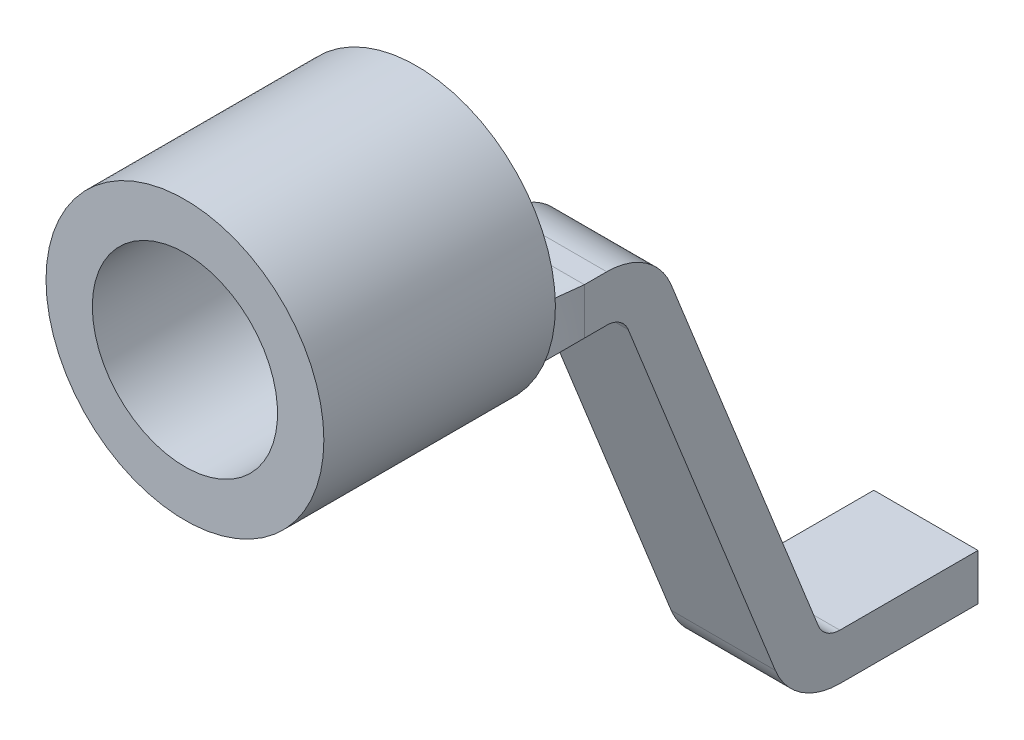
ISO-10303-21;
HEADER;
FILE_DESCRIPTION(('STEP AP214'),'2;1');
FILE_NAME('part.step','',(''),(''),'','','');
FILE_SCHEMA(('AUTOMOTIVE_DESIGN { 1 0 10303 214 1 1 1 1 }'));
ENDSEC;
DATA;
#1=APPLICATION_CONTEXT('core data for automotive mechanical design processes');
#2=APPLICATION_PROTOCOL_DEFINITION('international standard','automotive_design',2000,#1);
#3=PRODUCT_CONTEXT('',#1,'mechanical');
#4=PRODUCT('Part','Part','',(#3));
#5=PRODUCT_RELATED_PRODUCT_CATEGORY('part','',(#4));
#6=PRODUCT_DEFINITION_FORMATION('','',#4);
#7=PRODUCT_DEFINITION_CONTEXT('part definition',#1,'design');
#8=PRODUCT_DEFINITION('design','',#6,#7);
#9=PRODUCT_DEFINITION_SHAPE('','',#8);
#10=(LENGTH_UNIT() NAMED_UNIT(*) SI_UNIT(.MILLI.,.METRE.));
#11=(NAMED_UNIT(*) PLANE_ANGLE_UNIT() SI_UNIT($,.RADIAN.));
#12=(NAMED_UNIT(*) SI_UNIT($,.STERADIAN.) SOLID_ANGLE_UNIT());
#13=UNCERTAINTY_MEASURE_WITH_UNIT(LENGTH_MEASURE(1.E-05),#10,'distance_accuracy_value','');
#14=(GEOMETRIC_REPRESENTATION_CONTEXT(3) GLOBAL_UNCERTAINTY_ASSIGNED_CONTEXT((#13)) GLOBAL_UNIT_ASSIGNED_CONTEXT((#10,
#11,#12)) REPRESENTATION_CONTEXT('',''));
#15=CARTESIAN_POINT('',(0.,0.,0.));
#16=DIRECTION('',(0.,0.,1.));
#17=DIRECTION('',(1.,0.,0.));
#18=AXIS2_PLACEMENT_3D('',#15,#16,#17);
#19=CARTESIAN_POINT('',(0.225,-0.656214886532175,-8.79668819152799));
#20=DIRECTION('',(-1.,0.,0.));
#21=DIRECTION('',(0.,0.,1.));
#22=AXIS2_PLACEMENT_3D('',#19,#20,#21);
#23=PLANE('',#22);
#24=CARTESIAN_POINT('',(0.225,-0.656214886532175,-8.79668819152799));
#25=DIRECTION('',(1.,0.,0.));
#26=DIRECTION('',(0.,0.,-1.));
#27=AXIS2_PLACEMENT_3D('',#24,#25,#26);
#28=CIRCLE('',#27,0.0999999999999994);
#29=CARTESIAN_POINT('',(0.225,-0.619161509804707,-8.88957009112685));
#30=VERTEX_POINT('',#29);
#31=CARTESIAN_POINT('',(0.225,-0.556214886532175,-8.79668819152799));
#32=VERTEX_POINT('',#31);
#33=EDGE_CURVE('E120',#30,#32,#28,.T.);
#34=ORIENTED_EDGE('',*,*,#33,.F.);
#35=DIRECTION('',(0.,0.928818995988579,0.370533767274682));
#36=VECTOR('',#35,1.);
#37=CARTESIAN_POINT('',(0.225,-2.2111601301824,-9.52466610967544));
#38=LINE('',#37,#36);
#39=CARTESIAN_POINT('',(0.225,-2.2111601301824,-9.52466610967544));
#40=VERTEX_POINT('',#39);
#41=EDGE_CURVE('E123',#30,#40,#38,.F.);
#42=ORIENTED_EDGE('',*,*,#41,.T.);
#43=CARTESIAN_POINT('',(0.225,-2.1,-9.80331180847201));
#44=DIRECTION('',(1.,0.,0.));
#45=DIRECTION('',(0.,0.,-1.));
#46=AXIS2_PLACEMENT_3D('',#43,#44,#45);
#47=CIRCLE('',#46,0.3);
#48=CARTESIAN_POINT('',(0.225,-2.4,-9.80331180847201));
#49=VERTEX_POINT('',#48);
#50=EDGE_CURVE('E139',#49,#40,#47,.F.);
#51=ORIENTED_EDGE('',*,*,#50,.F.);
#52=DIRECTION('',(0.,0.,1.));
#53=VECTOR('',#52,1.);
#54=CARTESIAN_POINT('',(0.225,-2.4,-10.4));
#55=LINE('',#54,#53);
#56=CARTESIAN_POINT('',(0.225,-2.4,-10.4));
#57=VERTEX_POINT('',#56);
#58=EDGE_CURVE('E159',#49,#57,#55,.F.);
#59=ORIENTED_EDGE('',*,*,#58,.T.);
#60=DIRECTION('',(0.,1.,0.));
#61=VECTOR('',#60,1.);
#62=CARTESIAN_POINT('',(0.225,-2.2,-10.4));
#63=LINE('',#62,#61);
#64=CARTESIAN_POINT('',(0.225,-2.2,-10.4));
#65=VERTEX_POINT('',#64);
#66=EDGE_CURVE('E171',#57,#65,#63,.T.);
#67=ORIENTED_EDGE('',*,*,#66,.T.);
#68=DIRECTION('',(0.,0.,-1.));
#69=VECTOR('',#68,1.);
#70=CARTESIAN_POINT('',(0.225,-2.2,-9.80331180847201));
#71=LINE('',#70,#69);
#72=CARTESIAN_POINT('',(0.225,-2.2,-9.80331180847201));
#73=VERTEX_POINT('',#72);
#74=EDGE_CURVE('E176',#65,#73,#71,.F.);
#75=ORIENTED_EDGE('',*,*,#74,.T.);
#76=CARTESIAN_POINT('',(0.225,-2.1,-9.80331180847201));
#77=DIRECTION('',(1.,0.,0.));
#78=DIRECTION('',(0.,0.,-1.));
#79=AXIS2_PLACEMENT_3D('',#76,#77,#78);
#80=CIRCLE('',#79,0.0999999999999994);
#81=CARTESIAN_POINT('',(0.225,-2.13705337672747,-9.71042990887315));
#82=VERTEX_POINT('',#81);
#83=EDGE_CURVE('E179',#73,#82,#80,.F.);
#84=ORIENTED_EDGE('',*,*,#83,.T.);
#85=DIRECTION('',(0.,-0.928818995988579,-0.370533767274682));
#86=VECTOR('',#85,1.);
#87=CARTESIAN_POINT('',(0.225,-0.545054756349771,-9.07533389032456));
#88=LINE('',#87,#86);
#89=CARTESIAN_POINT('',(0.225,-0.545054756349771,-9.07533389032456));
#90=VERTEX_POINT('',#89);
#91=EDGE_CURVE('E182',#82,#90,#88,.F.);
#92=ORIENTED_EDGE('',*,*,#91,.T.);
#93=CARTESIAN_POINT('',(0.225,-0.656214886532175,-8.79668819152799));
#94=DIRECTION('',(1.,0.,0.));
#95=DIRECTION('',(0.,0.,-1.));
#96=AXIS2_PLACEMENT_3D('',#93,#94,#95);
#97=CIRCLE('',#96,0.3);
#98=CARTESIAN_POINT('',(0.225,-0.356214886532175,-8.79668819152799));
#99=VERTEX_POINT('',#98);
#100=EDGE_CURVE('E187',#99,#90,#97,.F.);
#101=ORIENTED_EDGE('',*,*,#100,.F.);
#102=DIRECTION('',(0.,0.,1.));
#103=VECTOR('',#102,1.);
#104=CARTESIAN_POINT('',(0.225,-0.356214886532175,-8.79668819152799));
#105=LINE('',#104,#103);
#106=CARTESIAN_POINT('',(0.224999983599127,-0.356214889723793,-8.69999989066085));
#107=VERTEX_POINT('',#106);
#108=EDGE_CURVE('E130',#107,#99,#105,.F.);
#109=ORIENTED_EDGE('',*,*,#108,.F.);
#110=DIRECTION('',(0.,1.,0.));
#111=VECTOR('',#110,1.);
#112=CARTESIAN_POINT('',(0.225,-0.656214886532175,-8.7));
#113=LINE('',#112,#111);
#114=CARTESIAN_POINT('',(0.225,-0.556214886532175,-8.7));
#115=VERTEX_POINT('',#114);
#116=EDGE_CURVE('E189',#115,#107,#113,.T.);
#117=ORIENTED_EDGE('',*,*,#116,.F.);
#118=DIRECTION('',(0.,0.,1.));
#119=VECTOR('',#118,1.);
#120=CARTESIAN_POINT('',(0.225,-0.556214886532174,-8.79668819152799));
#121=LINE('',#120,#119);
#122=EDGE_CURVE('E126',#32,#115,#121,.T.);
#123=ORIENTED_EDGE('',*,*,#122,.F.);
#124=EDGE_LOOP('',(#34,#42,#51,#59,#67,#75,#84,#92,#101,#109,#117,#123));
#125=FACE_BOUND('',#124,.T.);
#126=ADVANCED_FACE('F18',(#125),#23,.F.);
#127=CARTESIAN_POINT('',(0.225,-0.656214886532175,-8.79668819152799));
#128=DIRECTION('',(1.,0.,0.));
#129=DIRECTION('',(0.,0.,-1.));
#130=AXIS2_PLACEMENT_3D('',#127,#128,#129);
#131=CYLINDRICAL_SURFACE('',#130,0.3);
#132=DIRECTION('',(1.,0.,0.));
#133=VECTOR('',#132,1.);
#134=CARTESIAN_POINT('',(0.225,-0.356214886532175,-8.79668819152799));
#135=LINE('',#134,#133);
#136=CARTESIAN_POINT('',(-0.225,-0.356214886532175,-8.79668819152799));
#137=VERTEX_POINT('',#136);
#138=EDGE_CURVE('E147',#137,#99,#135,.T.);
#139=ORIENTED_EDGE('',*,*,#138,.T.);
#140=ORIENTED_EDGE('',*,*,#100,.T.);
#141=DIRECTION('',(1.,0.,0.));
#142=VECTOR('',#141,1.);
#143=CARTESIAN_POINT('',(0.225,-0.545054756349771,-9.07533389032456));
#144=LINE('',#143,#142);
#145=CARTESIAN_POINT('',(-0.225,-0.545054756349771,-9.07533389032456));
#146=VERTEX_POINT('',#145);
#147=EDGE_CURVE('E180',#90,#146,#144,.F.);
#148=ORIENTED_EDGE('',*,*,#147,.T.);
#149=CARTESIAN_POINT('',(-0.225,-0.656214886532175,-8.79668819152799));
#150=DIRECTION('',(1.,0.,0.));
#151=DIRECTION('',(0.,0.,-1.));
#152=AXIS2_PLACEMENT_3D('',#149,#150,#151);
#153=CIRCLE('',#152,0.3);
#154=EDGE_CURVE('E309',#137,#146,#153,.F.);
#155=ORIENTED_EDGE('',*,*,#154,.F.);
#156=EDGE_LOOP('',(#139,#140,#148,#155));
#157=FACE_BOUND('',#156,.T.);
#158=ADVANCED_FACE('F389',(#157),#131,.T.);
#159=CARTESIAN_POINT('',(0.225,-0.545054756349771,-9.07533389032456));
#160=DIRECTION('',(0.,-0.370533767274682,0.928818995988579));
#161=DIRECTION('',(0.,-0.928818995988579,-0.370533767274682));
#162=AXIS2_PLACEMENT_3D('',#159,#160,#161);
#163=PLANE('',#162);
#164=DIRECTION('',(0.,-0.928818995988578,-0.370533767274683));
#165=VECTOR('',#164,1.);
#166=CARTESIAN_POINT('',(-0.225,-0.545054756349771,-9.07533389032456));
#167=LINE('',#166,#165);
#168=CARTESIAN_POINT('',(-0.225,-2.13705337672747,-9.71042990887315));
#169=VERTEX_POINT('',#168);
#170=EDGE_CURVE('E306',#146,#169,#167,.T.);
#171=ORIENTED_EDGE('',*,*,#170,.F.);
#172=ORIENTED_EDGE('',*,*,#147,.F.);
#173=ORIENTED_EDGE('',*,*,#91,.F.);
#174=DIRECTION('',(1.,0.,0.));
#175=VECTOR('',#174,1.);
#176=CARTESIAN_POINT('',(0.225,-2.13705337672747,-9.71042990887315));
#177=LINE('',#176,#175);
#178=EDGE_CURVE('E177',#82,#169,#177,.F.);
#179=ORIENTED_EDGE('',*,*,#178,.T.);
#180=EDGE_LOOP('',(#171,#172,#173,#179));
#181=FACE_BOUND('',#180,.T.);
#182=ADVANCED_FACE('F386',(#181),#163,.F.);
#183=CARTESIAN_POINT('',(0.225,-2.1,-9.80331180847201));
#184=DIRECTION('',(1.,0.,0.));
#185=DIRECTION('',(0.,0.,-1.));
#186=AXIS2_PLACEMENT_3D('',#183,#184,#185);
#187=CYLINDRICAL_SURFACE('',#186,0.0999999999999994);
#188=CARTESIAN_POINT('',(-0.225,-2.1,-9.80331180847201));
#189=DIRECTION('',(1.,0.,0.));
#190=DIRECTION('',(0.,0.,-1.));
#191=AXIS2_PLACEMENT_3D('',#188,#189,#190);
#192=CIRCLE('',#191,0.0999999999999994);
#193=CARTESIAN_POINT('',(-0.225,-2.2,-9.80331180847201));
#194=VERTEX_POINT('',#193);
#195=EDGE_CURVE('E303',#169,#194,#192,.T.);
#196=ORIENTED_EDGE('',*,*,#195,.F.);
#197=ORIENTED_EDGE('',*,*,#178,.F.);
#198=ORIENTED_EDGE('',*,*,#83,.F.);
#199=DIRECTION('',(1.,0.,0.));
#200=VECTOR('',#199,1.);
#201=CARTESIAN_POINT('',(0.225,-2.2,-9.80331180847201));
#202=LINE('',#201,#200);
#203=EDGE_CURVE('E174',#73,#194,#202,.F.);
#204=ORIENTED_EDGE('',*,*,#203,.T.);
#205=EDGE_LOOP('',(#196,#197,#198,#204));
#206=FACE_BOUND('',#205,.T.);
#207=ADVANCED_FACE('F382',(#206),#187,.F.);
#208=CARTESIAN_POINT('',(0.225,-2.2,-9.80331180847201));
#209=DIRECTION('',(0.,-1.,0.));
#210=DIRECTION('',(0.,0.,-1.));
#211=AXIS2_PLACEMENT_3D('',#208,#209,#210);
#212=PLANE('',#211);
#213=DIRECTION('',(0.,0.,1.));
#214=VECTOR('',#213,1.);
#215=CARTESIAN_POINT('',(-0.225,-2.2,-8.79668819152799));
#216=LINE('',#215,#214);
#217=CARTESIAN_POINT('',(-0.225,-2.2,-10.4));
#218=VERTEX_POINT('',#217);
#219=EDGE_CURVE('E166',#194,#218,#216,.F.);
#220=ORIENTED_EDGE('',*,*,#219,.F.);
#221=ORIENTED_EDGE('',*,*,#203,.F.);
#222=ORIENTED_EDGE('',*,*,#74,.F.);
#223=DIRECTION('',(1.,0.,0.));
#224=VECTOR('',#223,1.);
#225=CARTESIAN_POINT('',(0.225,-2.2,-10.4));
#226=LINE('',#225,#224);
#227=EDGE_CURVE('E169',#65,#218,#226,.F.);
#228=ORIENTED_EDGE('',*,*,#227,.T.);
#229=EDGE_LOOP('',(#220,#221,#222,#228));
#230=FACE_BOUND('',#229,.T.);
#231=ADVANCED_FACE('F378',(#230),#212,.F.);
#232=CARTESIAN_POINT('',(0.225,-2.2,-10.4));
#233=DIRECTION('',(0.,0.,1.));
#234=DIRECTION('',(1.,0.,0.));
#235=AXIS2_PLACEMENT_3D('',#232,#233,#234);
#236=PLANE('',#235);
#237=DIRECTION('',(0.,1.,0.));
#238=VECTOR('',#237,1.);
#239=CARTESIAN_POINT('',(-0.225,-0.656214886532175,-10.4));
#240=LINE('',#239,#238);
#241=CARTESIAN_POINT('',(-0.225,-2.4,-10.4));
#242=VERTEX_POINT('',#241);
#243=EDGE_CURVE('E162',#218,#242,#240,.F.);
#244=ORIENTED_EDGE('',*,*,#243,.F.);
#245=ORIENTED_EDGE('',*,*,#227,.F.);
#246=ORIENTED_EDGE('',*,*,#66,.F.);
#247=DIRECTION('',(1.,0.,0.));
#248=VECTOR('',#247,1.);
#249=CARTESIAN_POINT('',(0.225,-2.4,-10.4));
#250=LINE('',#249,#248);
#251=EDGE_CURVE('E157',#57,#242,#250,.F.);
#252=ORIENTED_EDGE('',*,*,#251,.T.);
#253=EDGE_LOOP('',(#244,#245,#246,#252));
#254=FACE_BOUND('',#253,.T.);
#255=ADVANCED_FACE('F374',(#254),#236,.F.);
#256=CARTESIAN_POINT('',(0.225,-2.4,-10.4));
#257=DIRECTION('',(0.,1.,0.));
#258=DIRECTION('',(0.,0.,1.));
#259=AXIS2_PLACEMENT_3D('',#256,#257,#258);
#260=PLANE('',#259);
#261=DIRECTION('',(0.,0.,1.));
#262=VECTOR('',#261,1.);
#263=CARTESIAN_POINT('',(-0.225,-2.4,-8.79668819152799));
#264=LINE('',#263,#262);
#265=CARTESIAN_POINT('',(-0.225,-2.4,-9.80331180847201));
#266=VERTEX_POINT('',#265);
#267=EDGE_CURVE('E165',#242,#266,#264,.T.);
#268=ORIENTED_EDGE('',*,*,#267,.F.);
#269=ORIENTED_EDGE('',*,*,#251,.F.);
#270=ORIENTED_EDGE('',*,*,#58,.F.);
#271=DIRECTION('',(1.,0.,0.));
#272=VECTOR('',#271,1.);
#273=CARTESIAN_POINT('',(0.225,-2.4,-9.80331180847201));
#274=LINE('',#273,#272);
#275=EDGE_CURVE('E154',#266,#49,#274,.T.);
#276=ORIENTED_EDGE('',*,*,#275,.F.);
#277=EDGE_LOOP('',(#268,#269,#270,#276));
#278=FACE_BOUND('',#277,.T.);
#279=ADVANCED_FACE('F370',(#278),#260,.F.);
#280=CARTESIAN_POINT('',(0.225,-2.1,-9.80331180847201));
#281=DIRECTION('',(1.,0.,0.));
#282=DIRECTION('',(0.,0.,-1.));
#283=AXIS2_PLACEMENT_3D('',#280,#281,#282);
#284=CYLINDRICAL_SURFACE('',#283,0.3);
#285=ORIENTED_EDGE('',*,*,#275,.T.);
#286=ORIENTED_EDGE('',*,*,#50,.T.);
#287=DIRECTION('',(1.,0.,0.));
#288=VECTOR('',#287,1.);
#289=CARTESIAN_POINT('',(0.225,-2.2111601301824,-9.52466610967544));
#290=LINE('',#289,#288);
#291=CARTESIAN_POINT('',(-0.225,-2.2111601301824,-9.52466610967544));
#292=VERTEX_POINT('',#291);
#293=EDGE_CURVE('E138',#40,#292,#290,.F.);
#294=ORIENTED_EDGE('',*,*,#293,.T.);
#295=CARTESIAN_POINT('',(-0.225,-2.1,-9.80331180847201));
#296=DIRECTION('',(1.,0.,0.));
#297=DIRECTION('',(0.,0.,-1.));
#298=AXIS2_PLACEMENT_3D('',#295,#296,#297);
#299=CIRCLE('',#298,0.3);
#300=EDGE_CURVE('E296',#266,#292,#299,.F.);
#301=ORIENTED_EDGE('',*,*,#300,.F.);
#302=EDGE_LOOP('',(#285,#286,#294,#301));
#303=FACE_BOUND('',#302,.T.);
#304=ADVANCED_FACE('F367',(#303),#284,.T.);
#305=CARTESIAN_POINT('',(0.225,-2.2111601301824,-9.52466610967544));
#306=DIRECTION('',(0.,0.370533767274682,-0.928818995988579));
#307=DIRECTION('',(0.,0.928818995988579,0.370533767274682));
#308=AXIS2_PLACEMENT_3D('',#305,#306,#307);
#309=PLANE('',#308);
#310=DIRECTION('',(0.,0.928818995988578,0.370533767274683));
#311=VECTOR('',#310,1.);
#312=CARTESIAN_POINT('',(-0.225,-2.2111601301824,-9.52466610967544));
#313=LINE('',#312,#311);
#314=CARTESIAN_POINT('',(-0.225,-0.619161509804707,-8.88957009112685));
#315=VERTEX_POINT('',#314);
#316=EDGE_CURVE('E293',#292,#315,#313,.T.);
#317=ORIENTED_EDGE('',*,*,#316,.F.);
#318=ORIENTED_EDGE('',*,*,#293,.F.);
#319=ORIENTED_EDGE('',*,*,#41,.F.);
#320=DIRECTION('',(1.,0.,0.));
#321=VECTOR('',#320,1.);
#322=CARTESIAN_POINT('',(0.225,-0.619161509804706,-8.88957009112685));
#323=LINE('',#322,#321);
#324=EDGE_CURVE('E136',#30,#315,#323,.F.);
#325=ORIENTED_EDGE('',*,*,#324,.T.);
#326=EDGE_LOOP('',(#317,#318,#319,#325));
#327=FACE_BOUND('',#326,.T.);
#328=ADVANCED_FACE('F135',(#327),#309,.F.);
#329=CARTESIAN_POINT('',(0.225,-0.656214886532175,-8.79668819152799));
#330=DIRECTION('',(1.,0.,0.));
#331=DIRECTION('',(0.,0.,-1.));
#332=AXIS2_PLACEMENT_3D('',#329,#330,#331);
#333=CYLINDRICAL_SURFACE('',#332,0.0999999999999994);
#334=CARTESIAN_POINT('',(-0.225,-0.656214886532175,-8.79668819152799));
#335=DIRECTION('',(1.,0.,0.));
#336=DIRECTION('',(0.,0.,-1.));
#337=AXIS2_PLACEMENT_3D('',#334,#335,#336);
#338=CIRCLE('',#337,0.0999999999999994);
#339=CARTESIAN_POINT('',(-0.225,-0.556214886532175,-8.79668819152799));
#340=VERTEX_POINT('',#339);
#341=EDGE_CURVE('E143',#315,#340,#338,.T.);
#342=ORIENTED_EDGE('',*,*,#341,.F.);
#343=ORIENTED_EDGE('',*,*,#324,.F.);
#344=ORIENTED_EDGE('',*,*,#33,.T.);
#345=DIRECTION('',(1.,0.,0.));
#346=VECTOR('',#345,1.);
#347=CARTESIAN_POINT('',(0.225,-0.556214886532175,-8.79668819152799));
#348=LINE('',#347,#346);
#349=EDGE_CURVE('E145',#32,#340,#348,.F.);
#350=ORIENTED_EDGE('',*,*,#349,.T.);
#351=EDGE_LOOP('',(#342,#343,#344,#350));
#352=FACE_BOUND('',#351,.T.);
#353=ADVANCED_FACE('F141',(#352),#333,.F.);
#354=CARTESIAN_POINT('',(0.225,-0.556214886532175,-8.79668819152799));
#355=DIRECTION('',(0.,1.,0.));
#356=DIRECTION('',(0.,0.,1.));
#357=AXIS2_PLACEMENT_3D('',#354,#355,#356);
#358=PLANE('',#357);
#359=DIRECTION('',(0.,0.,1.));
#360=VECTOR('',#359,1.);
#361=CARTESIAN_POINT('',(-0.225,-0.556214886532174,-8.79668819152799));
#362=LINE('',#361,#360);
#363=CARTESIAN_POINT('',(-0.225,-0.556214886532175,-8.7));
#364=VERTEX_POINT('',#363);
#365=EDGE_CURVE('E184',#340,#364,#362,.T.);
#366=ORIENTED_EDGE('',*,*,#365,.F.);
#367=ORIENTED_EDGE('',*,*,#349,.F.);
#368=ORIENTED_EDGE('',*,*,#122,.T.);
#369=DIRECTION('',(1.,0.,0.));
#370=VECTOR('',#369,1.);
#371=CARTESIAN_POINT('',(0.,-0.556214886532175,-8.7));
#372=LINE('',#371,#370);
#373=EDGE_CURVE('E288',#364,#115,#372,.T.);
#374=ORIENTED_EDGE('',*,*,#373,.F.);
#375=EDGE_LOOP('',(#366,#367,#368,#374));
#376=FACE_BOUND('',#375,.T.);
#377=ADVANCED_FACE('F359',(#376),#358,.F.);
#378=CARTESIAN_POINT('',(0.225,-0.356214886532175,-8.7));
#379=DIRECTION('',(0.,-1.,0.));
#380=DIRECTION('',(0.,0.,-1.));
#381=AXIS2_PLACEMENT_3D('',#378,#379,#380);
#382=PLANE('',#381);
#383=DIRECTION('',(0.,0.,1.));
#384=VECTOR('',#383,1.);
#385=CARTESIAN_POINT('',(-0.225,-0.356214886532175,-8.79668819152799));
#386=LINE('',#385,#384);
#387=CARTESIAN_POINT('',(-0.225,-0.356214886532175,-8.7));
#388=VERTEX_POINT('',#387);
#389=EDGE_CURVE('E310',#388,#137,#386,.F.);
#390=ORIENTED_EDGE('',*,*,#389,.F.);
#391=DIRECTION('',(-1.,0.,0.));
#392=VECTOR('',#391,1.);
#393=CARTESIAN_POINT('',(0.,-0.356214886532175,-8.7));
#394=LINE('',#393,#392);
#395=EDGE_CURVE('E151',#107,#388,#394,.T.);
#396=ORIENTED_EDGE('',*,*,#395,.F.);
#397=ORIENTED_EDGE('',*,*,#108,.T.);
#398=ORIENTED_EDGE('',*,*,#138,.F.);
#399=EDGE_LOOP('',(#390,#396,#397,#398));
#400=FACE_BOUND('',#399,.T.);
#401=ADVANCED_FACE('F356',(#400),#382,.F.);
#402=CARTESIAN_POINT('',(-0.225,-0.656214886532175,-8.79668819152799));
#403=DIRECTION('',(-1.,0.,0.));
#404=DIRECTION('',(0.,0.,1.));
#405=AXIS2_PLACEMENT_3D('',#402,#403,#404);
#406=PLANE('',#405);
#407=ORIENTED_EDGE('',*,*,#316,.T.);
#408=ORIENTED_EDGE('',*,*,#341,.T.);
#409=ORIENTED_EDGE('',*,*,#365,.T.);
#410=DIRECTION('',(0.,-1.,0.));
#411=VECTOR('',#410,1.);
#412=CARTESIAN_POINT('',(-0.225,-0.457288396273213,-8.7));
#413=LINE('',#412,#411);
#414=EDGE_CURVE('E215',#388,#364,#413,.T.);
#415=ORIENTED_EDGE('',*,*,#414,.F.);
#416=ORIENTED_EDGE('',*,*,#389,.T.);
#417=ORIENTED_EDGE('',*,*,#154,.T.);
#418=ORIENTED_EDGE('',*,*,#170,.T.);
#419=ORIENTED_EDGE('',*,*,#195,.T.);
#420=ORIENTED_EDGE('',*,*,#219,.T.);
#421=ORIENTED_EDGE('',*,*,#243,.T.);
#422=ORIENTED_EDGE('',*,*,#267,.T.);
#423=ORIENTED_EDGE('',*,*,#300,.T.);
#424=EDGE_LOOP('',(#407,#408,#409,#415,#416,#417,#418,#419,#420,#421,#422,#423));
#425=FACE_BOUND('',#424,.T.);
#426=ADVANCED_FACE('F231',(#425),#406,.T.);
#427=CARTESIAN_POINT('',(0.225,-0.556214886532175,-8.2));
#428=CARTESIAN_POINT('',(0.225,-0.556214886532175,-8.7));
#429=CARTESIAN_POINT('',(0.155473139183478,-0.584339886532175,-8.2));
#430=CARTESIAN_POINT('',(0.15,-0.556214886532175,-8.7));
#431=CARTESIAN_POINT('',(0.0778402017205783,-0.6,-8.2));
#432=CARTESIAN_POINT('',(0.0749999999999999,-0.556214886532175,-8.7));
#433=CARTESIAN_POINT('',(-0.0778402017205781,-0.6,-8.2));
#434=CARTESIAN_POINT('',(-0.0750000000000001,-0.556214886532175,-8.7));
#435=CARTESIAN_POINT('',(-0.155473139183478,-0.584339886532175,-8.2));
#436=CARTESIAN_POINT('',(-0.15,-0.556214886532175,-8.7));
#437=CARTESIAN_POINT('',(-0.225,-0.556214886532175,-8.2));
#438=CARTESIAN_POINT('',(-0.225,-0.556214886532175,-8.7));
#439=B_SPLINE_SURFACE_WITH_KNOTS('',3,1,((#427,#428),(#429,#430),(#431,#432),(#433,#434),(#435,
#436),(#437,#438)),.UNSPECIFIED.,.F.,.F.,.F.,(4,2,4),(2,2),(0.,0.5,1.),(0.,1.),.UNSPECIFIED.);
#440=CARTESIAN_POINT('',(0.225,-0.556214886532175,-8.20000000015858));
#441=CARTESIAN_POINT('',(0.225,-0.556214886532175,-8.26738111335785));
#442=CARTESIAN_POINT('',(0.225,-0.556214886532175,-8.33476222655712));
#443=CARTESIAN_POINT('',(0.225,-0.556214886532175,-8.45178611646365));
#444=CARTESIAN_POINT('',(0.225,-0.556214886532175,-8.50142889317092));
#445=CARTESIAN_POINT('',(0.225,-0.556214886532175,-8.60071444658546));
#446=CARTESIAN_POINT('',(0.225,-0.556214886532175,-8.65035722329273));
#447=CARTESIAN_POINT('',(0.225,-0.556214886532175,-8.7));
#448=B_SPLINE_CURVE_WITH_KNOTS('',3,(#440,#441,#442,#443,#444,#445,#446,#447),.UNSPECIFIED.,.F.,
.F.,(4,2,2,4),(0.,0.202143339597805,0.351071669719606,0.499999999841416),.UNSPECIFIED.);
#449=CARTESIAN_POINT('',(0.225175090043262,-0.556649823895789,-8.20000000015858));
#450=VERTEX_POINT('',#449);
#451=EDGE_CURVE('E256',#450,#115,#448,.T.);
#452=CARTESIAN_POINT('',(0.225,-0.556214886532175,-8.2));
#453=CARTESIAN_POINT('',(0.216269338703329,-0.559746102363361,-8.2));
#454=CARTESIAN_POINT('',(0.207453176337116,-0.563064677519512,-8.2));
#455=CARTESIAN_POINT('',(0.189599520785112,-0.569303313123354,-8.2));
#456=CARTESIAN_POINT('',(0.180560804047663,-0.572219874104915,-8.2));
#457=CARTESIAN_POINT('',(0.162292924092735,-0.577641926376812,-8.2));
#458=CARTESIAN_POINT('',(0.153062875451116,-0.580144430870225,-8.2));
#459=CARTESIAN_POINT('',(0.134442706723738,-0.584725277340994,-8.2));
#460=CARTESIAN_POINT('',(0.125051976261823,-0.586801137885077,-8.2));
#461=CARTESIAN_POINT('',(0.106141031713695,-0.590515748107865,-8.2));
#462=CARTESIAN_POINT('',(0.0966204273157555,-0.592152510845649,-8.2));
#463=CARTESIAN_POINT('',(0.0774803288012702,-0.594975947206018,-8.2));
#464=CARTESIAN_POINT('',(0.0678606112331755,-0.596161107488451,-8.2));
#465=CARTESIAN_POINT('',(0.0485529643319555,-0.598068390349088,-8.2));
#466=CARTESIAN_POINT('',(0.0388649290330745,-0.598789442315896,-8.2));
#467=CARTESIAN_POINT('',(0.0194512849500396,-0.599755582785358,-8.2));
#468=CARTESIAN_POINT('',(0.00972564247501984,-0.6,-8.2));
#469=CARTESIAN_POINT('',(-0.00972564247501962,-0.6,-8.2));
#470=CARTESIAN_POINT('',(-0.0194512849500394,-0.599755582785358,-8.2));
#471=CARTESIAN_POINT('',(-0.0388649290330743,-0.598789442315896,-8.2));
#472=CARTESIAN_POINT('',(-0.0485529643319553,-0.598068390349088,-8.2));
#473=CARTESIAN_POINT('',(-0.0678606112331753,-0.596161107488451,-8.2));
#474=CARTESIAN_POINT('',(-0.07748032880127,-0.594975947206018,-8.2));
#475=CARTESIAN_POINT('',(-0.0966204273157552,-0.592152510845649,-8.2));
#476=CARTESIAN_POINT('',(-0.106141031713695,-0.590515748107865,-8.2));
#477=CARTESIAN_POINT('',(-0.125051976261823,-0.586801137885077,-8.2));
#478=CARTESIAN_POINT('',(-0.134442706723738,-0.584725277340994,-8.2));
#479=CARTESIAN_POINT('',(-0.153062875451116,-0.580144430870225,-8.2));
#480=CARTESIAN_POINT('',(-0.162292924092734,-0.577641926376812,-8.2));
#481=CARTESIAN_POINT('',(-0.180560804047662,-0.572219874104915,-8.2));
#482=CARTESIAN_POINT('',(-0.189599520785112,-0.569303313123354,-8.2));
#483=CARTESIAN_POINT('',(-0.207453176337115,-0.563064677519512,-8.2));
#484=CARTESIAN_POINT('',(-0.216269338703329,-0.559746102363361,-8.2));
#485=CARTESIAN_POINT('',(-0.225,-0.556214886532175,-8.2));
#486=B_SPLINE_CURVE_WITH_KNOTS('',3,(#452,#453,#454,#455,#456,#457,#458,#459,#460,#461,#462,
#463,#464,#465,#466,#467,#468,#469,#470,#471,#472,#473,#474,#475,#476,#477,#478,#479,#480,#481,
#482,#483,#484,#485),.UNSPECIFIED.,.F.,.F.,(4,2,2,2,2,2,2,2,2,2,2,2,2,2,2,2,4),(0.,
0.0282497780141186,0.056731734561423,0.0854109459316557,0.114252513594535,0.14322246993633,
0.172288669583388,0.201421681483155,0.230595694500661,0.259769707518167,0.288902719417935,
0.317968919064993,0.346938875406788,0.375780443069667,0.4044596544399,0.432941610987204,
0.461191389001323),.UNSPECIFIED.);
#487=CARTESIAN_POINT('',(-0.225176516689392,-0.556651219911794,-8.19999999999791));
#488=VERTEX_POINT('',#487);
#489=EDGE_CURVE('E214',#488,#450,#486,.F.);
#490=CARTESIAN_POINT('',(-0.225,-0.556214886532175,-8.7));
#491=CARTESIAN_POINT('',(-0.225,-0.556214886532175,-8.63261766017264));
#492=CARTESIAN_POINT('',(-0.225,-0.556214886532175,-8.56523532034527));
#493=CARTESIAN_POINT('',(-0.225,-0.556214886532175,-8.44821081709826));
#494=CARTESIAN_POINT('',(-0.225,-0.556214886532174,-8.39856865367861));
#495=CARTESIAN_POINT('',(-0.225,-0.556214886532174,-8.2992843268393));
#496=CARTESIAN_POINT('',(-0.225,-0.556214886532174,-8.24964216341965));
#497=CARTESIAN_POINT('',(-0.225,-0.556214886532174,-8.2));
#498=B_SPLINE_CURVE_WITH_KNOTS('',3,(#490,#491,#492,#493,#494,#495,#496,#497),.UNSPECIFIED.,.F.,
.F.,(4,2,2,4),(0.,0.202147019482086,0.351073509741043,0.5),.UNSPECIFIED.);
#499=EDGE_CURVE('E211',#364,#488,#498,.T.);
#500=ORIENTED_EDGE('',*,*,#373,.T.);
#501=ORIENTED_EDGE('',*,*,#451,.F.);
#502=ORIENTED_EDGE('',*,*,#489,.F.);
#503=ORIENTED_EDGE('',*,*,#499,.F.);
#504=EDGE_LOOP('',(#500,#501,#502,#503));
#505=FACE_BOUND('',#504,.T.);
#506=ADVANCED_FACE('F223',(#505),#439,.T.);
#507=CARTESIAN_POINT('',(-0.15,-0.370809924354783,-8.2));
#508=CARTESIAN_POINT('',(-0.225,-0.356214886532175,-8.7));
#509=CARTESIAN_POINT('',(-0.103648759455652,-0.389559924354783,-8.2));
#510=CARTESIAN_POINT('',(-0.15,-0.356214886532175,-8.7));
#511=CARTESIAN_POINT('',(-0.0518934678137188,-0.4,-8.2));
#512=CARTESIAN_POINT('',(-0.0750000000000002,-0.356214886532175,-8.7));
#513=CARTESIAN_POINT('',(0.0518934678137188,-0.4,-8.2));
#514=CARTESIAN_POINT('',(0.0749999999999998,-0.356214886532175,-8.7));
#515=CARTESIAN_POINT('',(0.103648759455652,-0.389559924354783,-8.2));
#516=CARTESIAN_POINT('',(0.15,-0.356214886532175,-8.7));
#517=CARTESIAN_POINT('',(0.15,-0.370809924354783,-8.2));
#518=CARTESIAN_POINT('',(0.225,-0.356214886532175,-8.7));
#519=CARTESIAN_POINT('',(0.150927024810887,-0.370434924354783,-8.2));
#520=CARTESIAN_POINT('',(0.2265,-0.356214886532175,-8.7));
#521=CARTESIAN_POINT('',(0.151854049621774,-0.370059924354783,-8.2));
#522=CARTESIAN_POINT('',(0.228,-0.356214886532175,-8.7));
#523=CARTESIAN_POINT('',(0.152781074432661,-0.369684924354783,-8.2));
#524=CARTESIAN_POINT('',(0.2295,-0.356214886532175,-8.7));
#525=B_SPLINE_SURFACE_WITH_KNOTS('',3,1,((#507,#508),(#509,#510),(#511,#512),(#513,#514),(#515,
#516),(#517,#518),(#519,#520),(#521,#522),(#523,#524)),.UNSPECIFIED.,.F.,.F.,.F.,(4,2,3,4),(2,
2),(0.,0.5,1.,1.01),(0.,1.),.UNSPECIFIED.);
#526=CARTESIAN_POINT('',(-0.150002036956848,-0.370809527961953,-8.20001357971232));
#527=CARTESIAN_POINT('',(-0.159993401676083,-0.368865203348931,-8.26662267784055));
#528=CARTESIAN_POINT('',(-0.169984766395318,-0.366920878735908,-8.33323177596878));
#529=CARTESIAN_POINT('',(-0.187480109262127,-0.3635162761911,-8.44986739508085));
#530=CARTESIAN_POINT('',(-0.194984087409702,-0.362055998259315,-8.49989391606468));
#531=CARTESIAN_POINT('',(-0.209992043704851,-0.359135442395745,-8.59994695803234));
#532=CARTESIAN_POINT('',(-0.217496021852426,-0.35767516446396,-8.64997347901617));
#533=CARTESIAN_POINT('',(-0.225,-0.356214886532175,-8.7));
#534=B_SPLINE_CURVE_WITH_KNOTS('',3,(#526,#527,#528,#529,#530,#531,#532,#533),.UNSPECIFIED.,.F.,
.F.,(4,2,2,4),(0.,0.202147019482089,0.353968803534336,0.505790587586579),.UNSPECIFIED.);
#535=CARTESIAN_POINT('',(-0.150118975667444,-0.371098539237621,-8.20000447516673));
#536=VERTEX_POINT('',#535);
#537=EDGE_CURVE('E40',#536,#388,#534,.T.);
#538=CARTESIAN_POINT('',(-0.150002725924262,-0.370809393888547,-8.20001817282841));
#539=CARTESIAN_POINT('',(-0.103650444121934,-0.389558712407482,-8.20001817282841));
#540=CARTESIAN_POINT('',(-0.0518943076358081,-0.399998408601292,-8.20001817282841));
#541=CARTESIAN_POINT('',(0.0518943076358081,-0.399998408601292,-8.20001817282841));
#542=CARTESIAN_POINT('',(0.103650444121934,-0.389558712407482,-8.20001817282841));
#543=CARTESIAN_POINT('',(0.150002725924262,-0.370809393888547,-8.20001817282841));
#544=CARTESIAN_POINT('',(0.150929771560308,-0.370434407518169,-8.20001817282841));
#545=CARTESIAN_POINT('',(0.151856817196355,-0.37005942114779,-8.20001817282841));
#546=CARTESIAN_POINT('',(0.152783862832401,-0.369684434777411,-8.20001817282841));
#547=B_SPLINE_CURVE_WITH_KNOTS('',3,(#538,#539,#540,#541,#542,#543,#544,#545,#546),
.UNSPECIFIED.,.F.,.F.,(4,2,3,4),(0.,0.5,1.,1.01),.UNSPECIFIED.);
#548=CARTESIAN_POINT('',(0.150118712253969,-0.37110061912969,-8.20000456514548));
#549=VERTEX_POINT('',#548);
#550=EDGE_CURVE('E328',#536,#549,#547,.T.);
#551=CARTESIAN_POINT('',(0.224999967198134,-0.35621489291541,-8.69999978132172));
#552=CARTESIAN_POINT('',(0.21500878436178,-0.358159182133949,-8.63339189574548));
#553=CARTESIAN_POINT('',(0.205017601525377,-0.360103471352487,-8.56678401016925));
#554=CARTESIAN_POINT('',(0.187522354816651,-0.363508055184887,-8.45014903211095));
#555=CARTESIAN_POINT('',(0.180018290944338,-0.364968349798748,-8.40012193962889));
#556=CARTESIAN_POINT('',(0.165010163199711,-0.367888939026472,-8.30006775466477));
#557=CARTESIAN_POINT('',(0.157506099327398,-0.369349233640333,-8.2500406621827));
#558=CARTESIAN_POINT('',(0.150002035455096,-0.370809528254195,-8.20001356970064));
#559=B_SPLINE_CURVE_WITH_KNOTS('',3,(#551,#552,#553,#554,#555,#556,#557,#558),.UNSPECIFIED.,.F.,
.F.,(4,2,2,4),(0.,0.202143339597805,0.353966858047715,0.505790376497625),.UNSPECIFIED.);
#560=EDGE_CURVE('E276',#107,#549,#559,.T.);
#561=ORIENTED_EDGE('',*,*,#395,.T.);
#562=ORIENTED_EDGE('',*,*,#537,.F.);
#563=ORIENTED_EDGE('',*,*,#550,.T.);
#564=ORIENTED_EDGE('',*,*,#560,.F.);
#565=EDGE_LOOP('',(#561,#562,#563,#564));
#566=FACE_BOUND('',#565,.T.);
#567=ADVANCED_FACE('F230',(#566),#525,.T.);
#568=CARTESIAN_POINT('',(0.14925,-0.370955874733009,-8.195));
#569=CARTESIAN_POINT('',(0.15,-0.370809924354783,-8.2));
#570=CARTESIAN_POINT('',(0.225,-0.356214886532175,-8.7));
#571=CARTESIAN_POINT('',(0.161875,-0.401832376699537,-8.195));
#572=CARTESIAN_POINT('',(0.1625,-0.401710751384348,-8.2));
#573=CARTESIAN_POINT('',(0.225,-0.389548219865508,-8.7));
#574=CARTESIAN_POINT('',(0.1745,-0.432708878666064,-8.195));
#575=CARTESIAN_POINT('',(0.175,-0.432611578413914,-8.2));
#576=CARTESIAN_POINT('',(0.225,-0.422881553198842,-8.7));
#577=CARTESIAN_POINT('',(0.19975,-0.494461882599119,-8.195));
#578=CARTESIAN_POINT('',(0.2,-0.494413232473044,-8.2));
#579=CARTESIAN_POINT('',(0.225,-0.489548219865508,-8.7));
#580=CARTESIAN_POINT('',(0.212375,-0.525338384565647,-8.195));
#581=CARTESIAN_POINT('',(0.2125,-0.525314059502609,-8.2));
#582=CARTESIAN_POINT('',(0.225,-0.522881553198841,-8.7));
#583=CARTESIAN_POINT('',(0.225,-0.556214886532175,-8.195));
#584=CARTESIAN_POINT('',(0.225,-0.556214886532175,-8.2));
#585=CARTESIAN_POINT('',(0.225,-0.556214886532175,-8.7));
#586=CARTESIAN_POINT('',(0.225270596624223,-0.55687667482524,-8.195));
#587=CARTESIAN_POINT('',(0.225267917449725,-0.556877196193948,-8.2));
#588=CARTESIAN_POINT('',(0.225,-0.556929333064776,-8.7));
#589=CARTESIAN_POINT('',(0.225541193248445,-0.557538463118305,-8.195));
#590=CARTESIAN_POINT('',(0.225535834899451,-0.557539505855722,-8.2));
#591=CARTESIAN_POINT('',(0.225,-0.557643779597377,-8.7));
#592=CARTESIAN_POINT('',(0.225811789872668,-0.55820025141137,-8.195));
#593=CARTESIAN_POINT('',(0.225803752349176,-0.558201815517495,-8.2));
#594=CARTESIAN_POINT('',(0.225,-0.558358226129978,-8.7));
#595=B_SPLINE_SURFACE_WITH_KNOTS('',3,1,((#568,#569,#570),(#571,#572,#573),(#574,#575,#576),
(#577,#578,#579),(#580,#581,#582),(#583,#584,#585),(#586,#587,#588),(#589,#590,#591),(#592,#593,
#594)),.UNSPECIFIED.,.F.,.F.,.F.,(4,2,3,4),(2,1,2),(0.,0.5,1.,1.01071669798902),(-0.01,0.,1.),.UNSPECIFIED.);
#596=DIRECTION('',(-0.374992614655101,0.927027798371835,0.));
#597=VECTOR('',#596,1.);
#598=CARTESIAN_POINT('',(0.225350388269259,-0.557084677402196,-8.2));
#599=LINE('',#598,#597);
#600=EDGE_CURVE('E208',#450,#549,#599,.T.);
#601=ORIENTED_EDGE('',*,*,#116,.T.);
#602=ORIENTED_EDGE('',*,*,#560,.T.);
#603=ORIENTED_EDGE('',*,*,#600,.F.);
#604=ORIENTED_EDGE('',*,*,#451,.T.);
#605=EDGE_LOOP('',(#601,#602,#603,#604));
#606=FACE_BOUND('',#605,.T.);
#607=ADVANCED_FACE('F259',(#606),#595,.T.);
#608=CARTESIAN_POINT('',(-0.225805132305779,-0.558205226861517,-8.2));
#609=CARTESIAN_POINT('',(-0.225,-0.558361906014251,-8.7));
#610=CARTESIAN_POINT('',(-0.225536754870519,-0.557541780085069,-8.2));
#611=CARTESIAN_POINT('',(-0.225,-0.557646232853559,-8.7));
#612=CARTESIAN_POINT('',(-0.22526837743526,-0.556878333308622,-8.2));
#613=CARTESIAN_POINT('',(-0.225,-0.556930559692867,-8.7));
#614=CARTESIAN_POINT('',(-0.225,-0.556214886532174,-8.2));
#615=CARTESIAN_POINT('',(-0.225,-0.556214886532175,-8.7));
#616=CARTESIAN_POINT('',(-0.2125,-0.525314059502609,-8.2));
#617=CARTESIAN_POINT('',(-0.225,-0.522881553198841,-8.7));
#618=CARTESIAN_POINT('',(-0.2,-0.494413232473044,-8.2));
#619=CARTESIAN_POINT('',(-0.225,-0.489548219865508,-8.7));
#620=CARTESIAN_POINT('',(-0.175,-0.432611578413914,-8.2));
#621=CARTESIAN_POINT('',(-0.225,-0.422881553198841,-8.7));
#622=CARTESIAN_POINT('',(-0.1625,-0.401710751384348,-8.2));
#623=CARTESIAN_POINT('',(-0.225,-0.389548219865508,-8.7));
#624=CARTESIAN_POINT('',(-0.15,-0.370809924354783,-8.2));
#625=CARTESIAN_POINT('',(-0.225,-0.356214886532175,-8.7));
#626=B_SPLINE_SURFACE_WITH_KNOTS('',3,1,((#608,#609),(#610,#611),(#612,#613),(#614,#615),(#616,
#617),(#618,#619),(#620,#621),(#622,#623),(#624,#625)),.UNSPECIFIED.,.F.,.F.,.F.,(4,3,2,4),(2,
2),(-0.010735097410381,0.,0.5,1.),(0.,1.),.UNSPECIFIED.);
#627=DIRECTION('',(-0.37500535189603,-0.927022645920441,0.));
#628=VECTOR('',#627,1.);
#629=CARTESIAN_POINT('',(-0.15023304123332,-0.371389054356229,-8.2));
#630=LINE('',#629,#628);
#631=EDGE_CURVE('E204',#536,#488,#630,.T.);
#632=ORIENTED_EDGE('',*,*,#414,.T.);
#633=ORIENTED_EDGE('',*,*,#499,.T.);
#634=ORIENTED_EDGE('',*,*,#631,.F.);
#635=ORIENTED_EDGE('',*,*,#537,.T.);
#636=EDGE_LOOP('',(#632,#633,#634,#635));
#637=FACE_BOUND('',#636,.T.);
#638=ADVANCED_FACE('F20',(#637),#626,.T.);
#639=CARTESIAN_POINT('',(0.,0.,-8.2));
#640=DIRECTION('',(0.,0.,-1.));
#641=DIRECTION('',(-1.,0.,0.));
#642=AXIS2_PLACEMENT_3D('',#639,#640,#641);
#643=CYLINDRICAL_SURFACE('',#642,0.4);
#644=CARTESIAN_POINT('',(0.,0.,-8.2));
#645=DIRECTION('',(0.,0.,-1.));
#646=DIRECTION('',(-1.,0.,0.));
#647=AXIS2_PLACEMENT_3D('',#644,#645,#646);
#648=CIRCLE('',#647,0.4);
#649=EDGE_CURVE('E205',#549,#536,#648,.F.);
#650=ORIENTED_EDGE('',*,*,#649,.F.);
#651=ORIENTED_EDGE('',*,*,#550,.F.);
#652=EDGE_LOOP('',(#650,#651));
#653=FACE_BOUND('',#652,.T.);
#654=CARTESIAN_POINT('',(0.,0.,-7.2));
#655=DIRECTION('',(0.,0.,-1.));
#656=DIRECTION('',(-1.,0.,0.));
#657=AXIS2_PLACEMENT_3D('',#654,#655,#656);
#658=CIRCLE('',#657,0.4);
#659=CARTESIAN_POINT('',(-0.4,0.,-7.2));
#660=VERTEX_POINT('',#659);
#661=EDGE_CURVE('E201',#660,#660,#658,.F.);
#662=ORIENTED_EDGE('',*,*,#661,.T.);
#663=EDGE_LOOP('',(#662));
#664=FACE_BOUND('',#663,.T.);
#665=ADVANCED_FACE('F326',(#653,#664),#643,.F.);
#666=CARTESIAN_POINT('',(0.,0.,-8.2));
#667=DIRECTION('',(0.,0.,-1.));
#668=DIRECTION('',(-1.,0.,0.));
#669=AXIS2_PLACEMENT_3D('',#666,#667,#668);
#670=PLANE('',#669);
#671=ORIENTED_EDGE('',*,*,#649,.T.);
#672=ORIENTED_EDGE('',*,*,#631,.T.);
#673=CARTESIAN_POINT('',(0.,0.,-8.2));
#674=DIRECTION('',(0.,0.,-1.));
#675=DIRECTION('',(-1.,0.,0.));
#676=AXIS2_PLACEMENT_3D('',#673,#674,#675);
#677=CIRCLE('',#676,0.6);
#678=EDGE_CURVE('E31',#450,#488,#677,.F.);
#679=ORIENTED_EDGE('',*,*,#678,.F.);
#680=ORIENTED_EDGE('',*,*,#600,.T.);
#681=EDGE_LOOP('',(#671,#672,#679,#680));
#682=FACE_BOUND('',#681,.T.);
#683=ADVANCED_FACE('F324',(#682),#670,.T.);
#684=CARTESIAN_POINT('',(0.,0.,-7.2));
#685=DIRECTION('',(0.,0.,-1.));
#686=DIRECTION('',(-1.,0.,0.));
#687=AXIS2_PLACEMENT_3D('',#684,#685,#686);
#688=PLANE('',#687);
#689=ORIENTED_EDGE('',*,*,#661,.F.);
#690=EDGE_LOOP('',(#689));
#691=FACE_BOUND('',#690,.T.);
#692=CARTESIAN_POINT('',(0.,0.,-7.2));
#693=DIRECTION('',(0.,0.,-1.));
#694=DIRECTION('',(-1.,0.,0.));
#695=AXIS2_PLACEMENT_3D('',#692,#693,#694);
#696=CIRCLE('',#695,0.6);
#697=CARTESIAN_POINT('',(-0.6,0.,-7.2));
#698=VERTEX_POINT('',#697);
#699=EDGE_CURVE('E11',#698,#698,#696,.T.);
#700=ORIENTED_EDGE('',*,*,#699,.F.);
#701=EDGE_LOOP('',(#700));
#702=FACE_BOUND('',#701,.T.);
#703=ADVANCED_FACE('F399',(#691,#702),#688,.F.);
#704=CARTESIAN_POINT('',(0.,0.,-8.2));
#705=DIRECTION('',(0.,0.,-1.));
#706=DIRECTION('',(-1.,0.,0.));
#707=AXIS2_PLACEMENT_3D('',#704,#705,#706);
#708=CYLINDRICAL_SURFACE('',#707,0.6);
#709=ORIENTED_EDGE('',*,*,#699,.T.);
#710=EDGE_LOOP('',(#709));
#711=FACE_BOUND('',#710,.T.);
#712=ORIENTED_EDGE('',*,*,#678,.T.);
#713=ORIENTED_EDGE('',*,*,#489,.T.);
#714=EDGE_LOOP('',(#712,#713));
#715=FACE_BOUND('',#714,.T.);
#716=ADVANCED_FACE('F397',(#711,#715),#708,.T.);
#717=CLOSED_SHELL('',(#126,#158,#182,#207,#231,#255,#279,#304,#328,#353,#377,#401,#426,#506,
#567,#607,#638,#665,#683,#703,#716));
#718=MANIFOLD_SOLID_BREP('B1',#717);
#719=ADVANCED_BREP_SHAPE_REPRESENTATION('',(#18,#718),#14);
#720=SHAPE_DEFINITION_REPRESENTATION(#9,#719);
ENDSEC;
END-ISO-10303-21;
